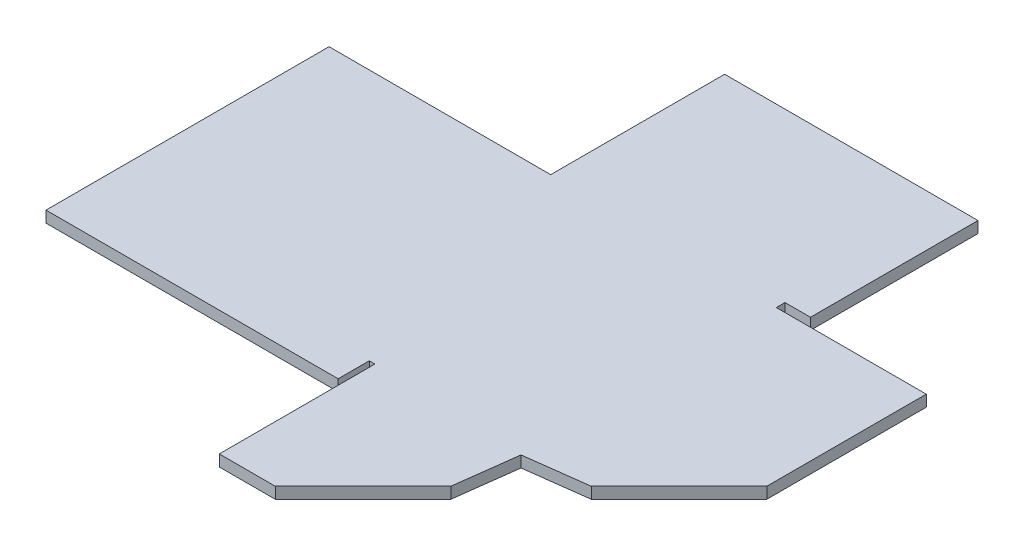
ISO-10303-21;
HEADER;
FILE_DESCRIPTION(('STEP AP214'),'2;1');
FILE_NAME('part.step','',(''),(''),'','','');
FILE_SCHEMA(('AUTOMOTIVE_DESIGN { 1 0 10303 214 1 1 1 1 }'));
ENDSEC;
DATA;
#1=APPLICATION_CONTEXT('core data for automotive mechanical design processes');
#2=APPLICATION_PROTOCOL_DEFINITION('international standard','automotive_design',2000,#1);
#3=PRODUCT_CONTEXT('',#1,'mechanical');
#4=PRODUCT('Part','Part','',(#3));
#5=PRODUCT_RELATED_PRODUCT_CATEGORY('part','',(#4));
#6=PRODUCT_DEFINITION_FORMATION('','',#4);
#7=PRODUCT_DEFINITION_CONTEXT('part definition',#1,'design');
#8=PRODUCT_DEFINITION('design','',#6,#7);
#9=PRODUCT_DEFINITION_SHAPE('','',#8);
#10=(LENGTH_UNIT() NAMED_UNIT(*) SI_UNIT(.MILLI.,.METRE.));
#11=(NAMED_UNIT(*) PLANE_ANGLE_UNIT() SI_UNIT($,.RADIAN.));
#12=(NAMED_UNIT(*) SI_UNIT($,.STERADIAN.) SOLID_ANGLE_UNIT());
#13=UNCERTAINTY_MEASURE_WITH_UNIT(LENGTH_MEASURE(1.E-05),#10,'distance_accuracy_value','');
#14=(GEOMETRIC_REPRESENTATION_CONTEXT(3) GLOBAL_UNCERTAINTY_ASSIGNED_CONTEXT((#13)) GLOBAL_UNIT_ASSIGNED_CONTEXT((#10,
#11,#12)) REPRESENTATION_CONTEXT('',''));
#15=CARTESIAN_POINT('',(0.,0.,0.));
#16=DIRECTION('',(0.,0.,1.));
#17=DIRECTION('',(1.,0.,0.));
#18=AXIS2_PLACEMENT_3D('',#15,#16,#17);
#19=CARTESIAN_POINT('',(-74.445939247954,-1.99999999999994,0.));
#20=DIRECTION('',(0.,0.,1.));
#21=DIRECTION('',(1.,0.,0.));
#22=AXIS2_PLACEMENT_3D('',#19,#20,#21);
#23=PLANE('',#22);
#24=DIRECTION('',(1.,0.,0.));
#25=VECTOR('',#24,1.);
#26=CARTESIAN_POINT('',(-74.445939247954,-1.99999999999994,0.));
#27=LINE('',#26,#25);
#28=CARTESIAN_POINT('',(-83.9155039215777,-2.00000000000312,0.));
#29=VERTEX_POINT('',#28);
#30=CARTESIAN_POINT('',(-32.3072256105192,-2.,0.));
#31=VERTEX_POINT('',#30);
#32=EDGE_CURVE('E100',#29,#31,#27,.T.);
#33=ORIENTED_EDGE('',*,*,#32,.T.);
#34=DIRECTION('',(0.,-1.,0.));
#35=VECTOR('',#34,1.);
#36=CARTESIAN_POINT('',(-32.3072256105192,0.,0.));
#37=LINE('',#36,#35);
#38=CARTESIAN_POINT('',(-32.3072256105192,0.,0.));
#39=VERTEX_POINT('',#38);
#40=EDGE_CURVE('E213',#39,#31,#37,.T.);
#41=ORIENTED_EDGE('',*,*,#40,.F.);
#42=DIRECTION('',(-1.,0.,0.));
#43=VECTOR('',#42,1.);
#44=CARTESIAN_POINT('',(-74.445939247954,0.,0.));
#45=LINE('',#44,#43);
#46=CARTESIAN_POINT('',(-83.9155039215786,-3.12250225675825E-12,0.));
#47=VERTEX_POINT('',#46);
#48=EDGE_CURVE('E83',#47,#39,#45,.F.);
#49=ORIENTED_EDGE('',*,*,#48,.F.);
#50=DIRECTION('',(4.48530101948563E-13,-1.,0.));
#51=VECTOR('',#50,1.);
#52=CARTESIAN_POINT('',(-83.9155039215782,-1.00000000000312,0.));
#53=LINE('',#52,#51);
#54=EDGE_CURVE('E210',#47,#29,#53,.T.);
#55=ORIENTED_EDGE('',*,*,#54,.T.);
#56=EDGE_LOOP('',(#33,#41,#49,#55));
#57=FACE_BOUND('',#56,.T.);
#58=ADVANCED_FACE('F74',(#57),#23,.T.);
#59=CARTESIAN_POINT('',(-74.445939247954,-1.99999999999994,-50.));
#60=DIRECTION('',(0.,0.,-1.));
#61=DIRECTION('',(-1.,0.,0.));
#62=AXIS2_PLACEMENT_3D('',#59,#60,#61);
#63=PLANE('',#62);
#64=DIRECTION('',(-1.,0.,0.));
#65=VECTOR('',#64,1.);
#66=CARTESIAN_POINT('',(-74.445939247954,-1.99999999999994,-50.));
#67=LINE('',#66,#65);
#68=CARTESIAN_POINT('',(-44.7573593128969,-2.,-50.));
#69=VERTEX_POINT('',#68);
#70=CARTESIAN_POINT('',(-83.9155039215777,-2.00000000000312,-50.));
#71=VERTEX_POINT('',#70);
#72=EDGE_CURVE('E206',#69,#71,#67,.T.);
#73=ORIENTED_EDGE('',*,*,#72,.T.);
#74=DIRECTION('',(4.48530101948563E-13,-1.,0.));
#75=VECTOR('',#74,1.);
#76=CARTESIAN_POINT('',(-83.9155039215782,-1.00000000000312,-50.));
#77=LINE('',#76,#75);
#78=CARTESIAN_POINT('',(-83.9155039215786,-3.12250225675825E-12,-50.));
#79=VERTEX_POINT('',#78);
#80=EDGE_CURVE('E224',#79,#71,#77,.T.);
#81=ORIENTED_EDGE('',*,*,#80,.F.);
#82=DIRECTION('',(-1.,0.,0.));
#83=VECTOR('',#82,1.);
#84=CARTESIAN_POINT('',(-74.445939247954,0.,-50.));
#85=LINE('',#84,#83);
#86=CARTESIAN_POINT('',(-44.7573593128969,0.,-50.));
#87=VERTEX_POINT('',#86);
#88=EDGE_CURVE('E13',#87,#79,#85,.T.);
#89=ORIENTED_EDGE('',*,*,#88,.F.);
#90=DIRECTION('',(0.,1.,0.));
#91=VECTOR('',#90,1.);
#92=CARTESIAN_POINT('',(-44.7573593128969,-2.,-49.9999999999953));
#93=LINE('',#92,#91);
#94=EDGE_CURVE('E229',#69,#87,#93,.T.);
#95=ORIENTED_EDGE('',*,*,#94,.F.);
#96=EDGE_LOOP('',(#73,#81,#89,#95));
#97=FACE_BOUND('',#96,.T.);
#98=ADVANCED_FACE('F362',(#97),#63,.T.);
#99=CARTESIAN_POINT('',(0.,0.,0.));
#100=DIRECTION('',(0.,1.,0.));
#101=DIRECTION('',(0.,0.,1.));
#102=AXIS2_PLACEMENT_3D('',#99,#100,#101);
#103=PLANE('',#102);
#104=ORIENTED_EDGE('',*,*,#88,.T.);
#105=DIRECTION('',(0.,0.,1.));
#106=VECTOR('',#105,1.);
#107=CARTESIAN_POINT('',(-83.9155039215786,-3.12250225675825E-12,-25.));
#108=LINE('',#107,#106);
#109=EDGE_CURVE('E219',#47,#79,#108,.F.);
#110=ORIENTED_EDGE('',*,*,#109,.F.);
#111=ORIENTED_EDGE('',*,*,#48,.T.);
#112=DIRECTION('',(0.,0.,1.));
#113=VECTOR('',#112,1.);
#114=CARTESIAN_POINT('',(-32.3072256105192,0.,-5.5));
#115=LINE('',#114,#113);
#116=CARTESIAN_POINT('',(-32.3072256105192,0.,-5.5));
#117=VERTEX_POINT('',#116);
#118=EDGE_CURVE('E248',#117,#39,#115,.T.);
#119=ORIENTED_EDGE('',*,*,#118,.F.);
#120=DIRECTION('',(-1.,0.,0.));
#121=VECTOR('',#120,1.);
#122=CARTESIAN_POINT('',(-31.3072256105192,0.,-5.5));
#123=LINE('',#122,#121);
#124=CARTESIAN_POINT('',(-31.3072256105192,0.,-5.5));
#125=VERTEX_POINT('',#124);
#126=EDGE_CURVE('E254',#125,#117,#123,.T.);
#127=ORIENTED_EDGE('',*,*,#126,.F.);
#128=DIRECTION('',(0.,0.,-1.));
#129=VECTOR('',#128,1.);
#130=CARTESIAN_POINT('',(-31.3072256105192,0.,14.2455742875643));
#131=LINE('',#130,#129);
#132=CARTESIAN_POINT('',(-31.3072256105192,-1.09287578986539E-13,21.9955742875643));
#133=VERTEX_POINT('',#132);
#134=EDGE_CURVE('E306',#125,#133,#131,.F.);
#135=ORIENTED_EDGE('',*,*,#134,.T.);
#136=DIRECTION('',(1.,0.,0.));
#137=VECTOR('',#136,1.);
#138=CARTESIAN_POINT('',(-17.9036128052596,-1.09287578986539E-13,21.9955742875643));
#139=LINE('',#138,#137);
#140=CARTESIAN_POINT('',(-21.4142135623731,-1.09287578986539E-13,21.9955742875643));
#141=VERTEX_POINT('',#140);
#142=EDGE_CURVE('E303',#133,#141,#139,.T.);
#143=ORIENTED_EDGE('',*,*,#142,.T.);
#144=DIRECTION('',(-0.707106781186548,0.,0.707106781186547));
#145=VECTOR('',#144,1.);
#146=CARTESIAN_POINT('',(-15.7839131838163,0.,16.3652739090075));
#147=LINE('',#146,#145);
#148=CARTESIAN_POINT('',(-5.9142135623731,0.,6.49557428756431));
#149=VERTEX_POINT('',#148);
#150=EDGE_CURVE('E222',#149,#141,#147,.T.);
#151=ORIENTED_EDGE('',*,*,#150,.F.);
#152=DIRECTION('',(-0.127565832419806,0.,0.991830105612369));
#153=VECTOR('',#152,1.);
#154=CARTESIAN_POINT('',(-4.5,0.,-4.5));
#155=LINE('',#154,#153);
#156=CARTESIAN_POINT('',(-4.5,0.,-4.5));
#157=VERTEX_POINT('',#156);
#158=EDGE_CURVE('E312',#157,#149,#155,.T.);
#159=ORIENTED_EDGE('',*,*,#158,.F.);
#160=DIRECTION('',(-0.991830105612369,0.,0.127565832419805));
#161=VECTOR('',#160,1.);
#162=CARTESIAN_POINT('',(6.4955742875643,0.,-5.91421356237309));
#163=LINE('',#162,#161);
#164=CARTESIAN_POINT('',(6.49557428756432,0.,-5.9142135623731));
#165=VERTEX_POINT('',#164);
#166=EDGE_CURVE('E299',#165,#157,#163,.T.);
#167=ORIENTED_EDGE('',*,*,#166,.F.);
#168=DIRECTION('',(-0.707106781186548,0.,0.707106781186547));
#169=VECTOR('',#168,1.);
#170=CARTESIAN_POINT('',(20.937460949919,-1.01481323344643E-13,-20.3561002247278));
#171=LINE('',#170,#169);
#172=CARTESIAN_POINT('',(21.9955742875643,-1.09287578986539E-13,-21.4142135623731));
#173=VERTEX_POINT('',#172);
#174=EDGE_CURVE('E332',#173,#165,#171,.T.);
#175=ORIENTED_EDGE('',*,*,#174,.F.);
#176=DIRECTION('',(0.,0.,1.));
#177=VECTOR('',#176,1.);
#178=CARTESIAN_POINT('',(21.9955742875643,-1.09287578986539E-13,-27.0479868870824));
#179=LINE('',#178,#177);
#180=CARTESIAN_POINT('',(21.9955742875643,-1.09287578986539E-13,-49.5959737741648));
#181=VERTEX_POINT('',#180);
#182=EDGE_CURVE('E293',#173,#181,#179,.F.);
#183=ORIENTED_EDGE('',*,*,#182,.T.);
#184=DIRECTION('',(-1.,0.,0.));
#185=VECTOR('',#184,1.);
#186=CARTESIAN_POINT('',(14.2455742875643,0.,-49.5959737741648));
#187=LINE('',#186,#185);
#188=CARTESIAN_POINT('',(-4.5,0.,-49.5959737741648));
#189=VERTEX_POINT('',#188);
#190=EDGE_CURVE('E291',#181,#189,#187,.T.);
#191=ORIENTED_EDGE('',*,*,#190,.T.);
#192=DIRECTION('',(0.,0.,-1.));
#193=VECTOR('',#192,1.);
#194=CARTESIAN_POINT('',(-4.5,0.,-50.3639186450424));
#195=LINE('',#194,#193);
#196=CARTESIAN_POINT('',(-4.5,0.,-51.1318635159199));
#197=VERTEX_POINT('',#196);
#198=EDGE_CURVE('E245',#197,#189,#195,.F.);
#199=ORIENTED_EDGE('',*,*,#198,.F.);
#200=DIRECTION('',(-1.,0.,0.));
#201=VECTOR('',#200,1.);
#202=CARTESIAN_POINT('',(0.,0.,-51.1318635159199));
#203=LINE('',#202,#201);
#204=CARTESIAN_POINT('',(0.,0.,-51.1318635159199));
#205=VERTEX_POINT('',#204);
#206=EDGE_CURVE('E287',#205,#197,#203,.T.);
#207=ORIENTED_EDGE('',*,*,#206,.F.);
#208=DIRECTION('',(0.,0.,1.));
#209=VECTOR('',#208,1.);
#210=CARTESIAN_POINT('',(0.,0.,-50.7278372900848));
#211=LINE('',#210,#209);
#212=CARTESIAN_POINT('',(0.,-2.08166817117217E-13,-80.7278372900848));
#213=VERTEX_POINT('',#212);
#214=EDGE_CURVE('E278',#213,#205,#211,.T.);
#215=ORIENTED_EDGE('',*,*,#214,.F.);
#216=DIRECTION('',(1.,0.,0.));
#217=VECTOR('',#216,1.);
#218=CARTESIAN_POINT('',(0.,-2.08166817117217E-13,-80.7278372900848));
#219=LINE('',#218,#217);
#220=CARTESIAN_POINT('',(-44.757359312897,-2.08166817117217E-13,-80.7278372900847));
#221=VERTEX_POINT('',#220);
#222=EDGE_CURVE('E276',#221,#213,#219,.T.);
#223=ORIENTED_EDGE('',*,*,#222,.F.);
#224=DIRECTION('',(0.,0.,-1.));
#225=VECTOR('',#224,1.);
#226=CARTESIAN_POINT('',(-44.757359312897,-2.08166817117217E-13,-80.7278372900847));
#227=LINE('',#226,#225);
#228=EDGE_CURVE('E195',#87,#221,#227,.T.);
#229=ORIENTED_EDGE('',*,*,#228,.F.);
#230=EDGE_LOOP('',(#104,#110,#111,#119,#127,#135,#143,#151,#159,#167,#175,#183,#191,#199,#207,
#215,#223,#229));
#231=FACE_BOUND('',#230,.T.);
#232=ADVANCED_FACE('F76',(#231),#103,.T.);
#233=CARTESIAN_POINT('',(-74.445939247954,-1.99999999999994,0.));
#234=DIRECTION('',(0.,1.,0.));
#235=DIRECTION('',(-1.,0.,0.));
#236=AXIS2_PLACEMENT_3D('',#233,#234,#235);
#237=PLANE('',#236);
#238=ORIENTED_EDGE('',*,*,#72,.F.);
#239=DIRECTION('',(0.,0.,-1.));
#240=VECTOR('',#239,1.);
#241=CARTESIAN_POINT('',(-44.757359312897,-2.0000000000002,-80.7278372900847));
#242=LINE('',#241,#240);
#243=CARTESIAN_POINT('',(-44.757359312897,-2.0000000000002,-80.7278372900847));
#244=VERTEX_POINT('',#243);
#245=EDGE_CURVE('E91',#69,#244,#242,.T.);
#246=ORIENTED_EDGE('',*,*,#245,.T.);
#247=DIRECTION('',(1.,0.,0.));
#248=VECTOR('',#247,1.);
#249=CARTESIAN_POINT('',(0.,-2.00000000000021,-80.7278372900847));
#250=LINE('',#249,#248);
#251=CARTESIAN_POINT('',(0.,-2.00000000000021,-80.7278372900847));
#252=VERTEX_POINT('',#251);
#253=EDGE_CURVE('E237',#244,#252,#250,.T.);
#254=ORIENTED_EDGE('',*,*,#253,.T.);
#255=DIRECTION('',(0.,0.,1.));
#256=VECTOR('',#255,1.);
#257=CARTESIAN_POINT('',(0.,-2.,-50.7278372900847));
#258=LINE('',#257,#256);
#259=CARTESIAN_POINT('',(0.,-2.00000000000001,-51.1318635159199));
#260=VERTEX_POINT('',#259);
#261=EDGE_CURVE('E234',#252,#260,#258,.T.);
#262=ORIENTED_EDGE('',*,*,#261,.T.);
#263=DIRECTION('',(1.,0.,0.));
#264=VECTOR('',#263,1.);
#265=CARTESIAN_POINT('',(0.,-2.00000000000002,-51.1318635159199));
#266=LINE('',#265,#264);
#267=CARTESIAN_POINT('',(-4.5,-2.00000000000001,-51.1318635159199));
#268=VERTEX_POINT('',#267);
#269=EDGE_CURVE('E289',#268,#260,#266,.T.);
#270=ORIENTED_EDGE('',*,*,#269,.F.);
#271=DIRECTION('',(0.,0.,-1.));
#272=VECTOR('',#271,1.);
#273=CARTESIAN_POINT('',(-4.5,-2.,-50.3639186450424));
#274=LINE('',#273,#272);
#275=CARTESIAN_POINT('',(-4.5,-2.00000000000001,-49.5959737741648));
#276=VERTEX_POINT('',#275);
#277=EDGE_CURVE('E231',#268,#276,#274,.F.);
#278=ORIENTED_EDGE('',*,*,#277,.T.);
#279=DIRECTION('',(-1.,0.,0.));
#280=VECTOR('',#279,1.);
#281=CARTESIAN_POINT('',(14.2455742875643,-2.00000000000006,-49.5959737741648));
#282=LINE('',#281,#280);
#283=CARTESIAN_POINT('',(21.9955742875643,-2.00000000000011,-49.5959737741648));
#284=VERTEX_POINT('',#283);
#285=EDGE_CURVE('E320',#284,#276,#282,.T.);
#286=ORIENTED_EDGE('',*,*,#285,.F.);
#287=DIRECTION('',(0.,0.,-1.));
#288=VECTOR('',#287,1.);
#289=CARTESIAN_POINT('',(21.9955742875643,-2.00000000000011,-27.0479868870824));
#290=LINE('',#289,#288);
#291=CARTESIAN_POINT('',(21.9955742875643,-2.00000000000011,-21.4142135623731));
#292=VERTEX_POINT('',#291);
#293=EDGE_CURVE('E324',#292,#284,#290,.T.);
#294=ORIENTED_EDGE('',*,*,#293,.F.);
#295=DIRECTION('',(-0.707106781186548,0.,0.707106781186547));
#296=VECTOR('',#295,1.);
#297=CARTESIAN_POINT('',(20.937460949919,-2.0000000000001,-20.3561002247278));
#298=LINE('',#297,#296);
#299=CARTESIAN_POINT('',(6.4955742875643,-2.,-5.91421356237309));
#300=VERTEX_POINT('',#299);
#301=EDGE_CURVE('E315',#292,#300,#298,.T.);
#302=ORIENTED_EDGE('',*,*,#301,.T.);
#303=DIRECTION('',(-0.991830105612369,0.,0.127565832419805));
#304=VECTOR('',#303,1.);
#305=CARTESIAN_POINT('',(6.4955742875643,-2.,-5.91421356237309));
#306=LINE('',#305,#304);
#307=CARTESIAN_POINT('',(-4.5,-2.,-4.5));
#308=VERTEX_POINT('',#307);
#309=EDGE_CURVE('E266',#300,#308,#306,.T.);
#310=ORIENTED_EDGE('',*,*,#309,.T.);
#311=DIRECTION('',(-0.127565832419806,0.,0.991830105612369));
#312=VECTOR('',#311,1.);
#313=CARTESIAN_POINT('',(-4.5,-2.,-4.5));
#314=LINE('',#313,#312);
#315=CARTESIAN_POINT('',(-5.9142135623731,-2.,6.4955742875643));
#316=VERTEX_POINT('',#315);
#317=EDGE_CURVE('E268',#308,#316,#314,.T.);
#318=ORIENTED_EDGE('',*,*,#317,.T.);
#319=DIRECTION('',(-0.707106781186548,0.,0.707106781186547));
#320=VECTOR('',#319,1.);
#321=CARTESIAN_POINT('',(-15.7839131838163,-2.00000000000007,16.3652739090075));
#322=LINE('',#321,#320);
#323=CARTESIAN_POINT('',(-21.4142135623731,-2.00000000000011,21.9955742875643));
#324=VERTEX_POINT('',#323);
#325=EDGE_CURVE('E317',#316,#324,#322,.T.);
#326=ORIENTED_EDGE('',*,*,#325,.T.);
#327=DIRECTION('',(1.,0.,0.));
#328=VECTOR('',#327,1.);
#329=CARTESIAN_POINT('',(-17.9036128052596,-2.00000000000011,21.9955742875643));
#330=LINE('',#329,#328);
#331=CARTESIAN_POINT('',(-31.3072256105192,-2.00000000000011,21.9955742875643));
#332=VERTEX_POINT('',#331);
#333=EDGE_CURVE('E337',#332,#324,#330,.T.);
#334=ORIENTED_EDGE('',*,*,#333,.F.);
#335=DIRECTION('',(0.,0.,1.));
#336=VECTOR('',#335,1.);
#337=CARTESIAN_POINT('',(-31.3072256105192,-2.00000000000006,14.2455742875643));
#338=LINE('',#337,#336);
#339=CARTESIAN_POINT('',(-31.3072256105192,-2.,-5.5));
#340=VERTEX_POINT('',#339);
#341=EDGE_CURVE('E334',#340,#332,#338,.T.);
#342=ORIENTED_EDGE('',*,*,#341,.F.);
#343=DIRECTION('',(1.,0.,0.));
#344=VECTOR('',#343,1.);
#345=CARTESIAN_POINT('',(0.,-2.,-5.5));
#346=LINE('',#345,#344);
#347=CARTESIAN_POINT('',(-32.3072256105192,-2.,-5.5));
#348=VERTEX_POINT('',#347);
#349=EDGE_CURVE('E257',#348,#340,#346,.T.);
#350=ORIENTED_EDGE('',*,*,#349,.F.);
#351=DIRECTION('',(0.,0.,-1.));
#352=VECTOR('',#351,1.);
#353=CARTESIAN_POINT('',(-32.3072256105192,-2.,0.));
#354=LINE('',#353,#352);
#355=EDGE_CURVE('E250',#31,#348,#354,.T.);
#356=ORIENTED_EDGE('',*,*,#355,.F.);
#357=ORIENTED_EDGE('',*,*,#32,.F.);
#358=DIRECTION('',(0.,0.,1.));
#359=VECTOR('',#358,1.);
#360=CARTESIAN_POINT('',(-83.9155039215777,-2.00000000000312,-25.));
#361=LINE('',#360,#359);
#362=EDGE_CURVE('E221',#29,#71,#361,.F.);
#363=ORIENTED_EDGE('',*,*,#362,.T.);
#364=EDGE_LOOP('',(#238,#246,#254,#262,#270,#278,#286,#294,#302,#310,#318,#326,#334,#342,#350,
#356,#357,#363));
#365=FACE_BOUND('',#364,.T.);
#366=ADVANCED_FACE('F360',(#365),#237,.F.);
#367=CARTESIAN_POINT('',(-15.7839131838163,-2.00000000000007,16.3652739090075));
#368=DIRECTION('',(0.707106781186547,0.,0.707106781186548));
#369=DIRECTION('',(-0.707106781186548,0.,0.707106781186547));
#370=AXIS2_PLACEMENT_3D('',#367,#368,#369);
#371=PLANE('',#370);
#372=ORIENTED_EDGE('',*,*,#150,.T.);
#373=DIRECTION('',(0.,-1.,0.));
#374=VECTOR('',#373,1.);
#375=CARTESIAN_POINT('',(-21.4142135623731,-2.00000000000011,21.9955742875643));
#376=LINE('',#375,#374);
#377=EDGE_CURVE('E342',#141,#324,#376,.T.);
#378=ORIENTED_EDGE('',*,*,#377,.T.);
#379=ORIENTED_EDGE('',*,*,#325,.F.);
#380=DIRECTION('',(0.,-1.,0.));
#381=VECTOR('',#380,1.);
#382=CARTESIAN_POINT('',(-5.9142135623731,-2.,6.4955742875643));
#383=LINE('',#382,#381);
#384=EDGE_CURVE('E309',#149,#316,#383,.T.);
#385=ORIENTED_EDGE('',*,*,#384,.F.);
#386=EDGE_LOOP('',(#372,#378,#379,#385));
#387=FACE_BOUND('',#386,.T.);
#388=ADVANCED_FACE('F372',(#387),#371,.T.);
#389=CARTESIAN_POINT('',(-17.9036128052596,-2.00000000000011,21.9955742875643));
#390=DIRECTION('',(0.,0.,-1.));
#391=DIRECTION('',(1.,0.,0.));
#392=AXIS2_PLACEMENT_3D('',#389,#390,#391);
#393=PLANE('',#392);
#394=ORIENTED_EDGE('',*,*,#377,.F.);
#395=ORIENTED_EDGE('',*,*,#142,.F.);
#396=DIRECTION('',(0.,-1.,0.));
#397=VECTOR('',#396,1.);
#398=CARTESIAN_POINT('',(-31.3072256105192,-2.00000000000011,21.9955742875643));
#399=LINE('',#398,#397);
#400=EDGE_CURVE('E340',#133,#332,#399,.T.);
#401=ORIENTED_EDGE('',*,*,#400,.T.);
#402=ORIENTED_EDGE('',*,*,#333,.T.);
#403=EDGE_LOOP('',(#394,#395,#401,#402));
#404=FACE_BOUND('',#403,.T.);
#405=ADVANCED_FACE('F418',(#404),#393,.F.);
#406=CARTESIAN_POINT('',(-31.3072256105192,-2.00000000000006,14.2455742875643));
#407=DIRECTION('',(1.,0.,0.));
#408=DIRECTION('',(0.,0.,1.));
#409=AXIS2_PLACEMENT_3D('',#406,#407,#408);
#410=PLANE('',#409);
#411=ORIENTED_EDGE('',*,*,#400,.F.);
#412=ORIENTED_EDGE('',*,*,#134,.F.);
#413=DIRECTION('',(0.,-1.,0.));
#414=VECTOR('',#413,1.);
#415=CARTESIAN_POINT('',(-31.3072256105192,0.,-5.5));
#416=LINE('',#415,#414);
#417=EDGE_CURVE('E263',#125,#340,#416,.T.);
#418=ORIENTED_EDGE('',*,*,#417,.T.);
#419=ORIENTED_EDGE('',*,*,#341,.T.);
#420=EDGE_LOOP('',(#411,#412,#418,#419));
#421=FACE_BOUND('',#420,.T.);
#422=ADVANCED_FACE('F414',(#421),#410,.F.);
#423=CARTESIAN_POINT('',(20.937460949919,-2.0000000000001,-20.3561002247278));
#424=DIRECTION('',(0.707106781186547,0.,0.707106781186548));
#425=DIRECTION('',(-0.707106781186548,0.,0.707106781186547));
#426=AXIS2_PLACEMENT_3D('',#423,#424,#425);
#427=PLANE('',#426);
#428=ORIENTED_EDGE('',*,*,#174,.T.);
#429=DIRECTION('',(0.,-1.,0.));
#430=VECTOR('',#429,1.);
#431=CARTESIAN_POINT('',(6.4955742875643,-2.,-5.9142135623731));
#432=LINE('',#431,#430);
#433=EDGE_CURVE('E329',#165,#300,#432,.T.);
#434=ORIENTED_EDGE('',*,*,#433,.T.);
#435=ORIENTED_EDGE('',*,*,#301,.F.);
#436=DIRECTION('',(0.,-1.,0.));
#437=VECTOR('',#436,1.);
#438=CARTESIAN_POINT('',(21.9955742875643,-2.00000000000011,-21.4142135623731));
#439=LINE('',#438,#437);
#440=EDGE_CURVE('E327',#173,#292,#439,.T.);
#441=ORIENTED_EDGE('',*,*,#440,.F.);
#442=EDGE_LOOP('',(#428,#434,#435,#441));
#443=FACE_BOUND('',#442,.T.);
#444=ADVANCED_FACE('F410',(#443),#427,.T.);
#445=CARTESIAN_POINT('',(21.9955742875643,-2.00000000000011,-27.0479868870824));
#446=DIRECTION('',(-1.,0.,0.));
#447=DIRECTION('',(0.,0.,-1.));
#448=AXIS2_PLACEMENT_3D('',#445,#446,#447);
#449=PLANE('',#448);
#450=DIRECTION('',(0.,-1.,0.));
#451=VECTOR('',#450,1.);
#452=CARTESIAN_POINT('',(21.9955742875643,-2.00000000000011,-49.5959737741648));
#453=LINE('',#452,#451);
#454=EDGE_CURVE('E322',#181,#284,#453,.T.);
#455=ORIENTED_EDGE('',*,*,#454,.F.);
#456=ORIENTED_EDGE('',*,*,#182,.F.);
#457=ORIENTED_EDGE('',*,*,#440,.T.);
#458=ORIENTED_EDGE('',*,*,#293,.T.);
#459=EDGE_LOOP('',(#455,#456,#457,#458));
#460=FACE_BOUND('',#459,.T.);
#461=ADVANCED_FACE('F406',(#460),#449,.F.);
#462=CARTESIAN_POINT('',(14.2455742875643,-2.00000000000006,-49.5959737741648));
#463=DIRECTION('',(0.,0.,1.));
#464=DIRECTION('',(-1.,0.,0.));
#465=AXIS2_PLACEMENT_3D('',#462,#463,#464);
#466=PLANE('',#465);
#467=ORIENTED_EDGE('',*,*,#285,.T.);
#468=DIRECTION('',(0.,-1.,0.));
#469=VECTOR('',#468,1.);
#470=CARTESIAN_POINT('',(-4.5,0.,-49.5959737741648));
#471=LINE('',#470,#469);
#472=EDGE_CURVE('E242',#189,#276,#471,.T.);
#473=ORIENTED_EDGE('',*,*,#472,.F.);
#474=ORIENTED_EDGE('',*,*,#190,.F.);
#475=ORIENTED_EDGE('',*,*,#454,.T.);
#476=EDGE_LOOP('',(#467,#473,#474,#475));
#477=FACE_BOUND('',#476,.T.);
#478=ADVANCED_FACE('F402',(#477),#466,.F.);
#479=CARTESIAN_POINT('',(-4.5,-1.,-4.5));
#480=DIRECTION('',(0.991830105612369,0.,0.127565832419806));
#481=DIRECTION('',(-0.127565832419806,0.,0.991830105612369));
#482=AXIS2_PLACEMENT_3D('',#479,#480,#481);
#483=PLANE('',#482);
#484=DIRECTION('',(0.,-1.,0.));
#485=VECTOR('',#484,1.);
#486=CARTESIAN_POINT('',(-4.5,0.,-4.5));
#487=LINE('',#486,#485);
#488=EDGE_CURVE('E296',#157,#308,#487,.T.);
#489=ORIENTED_EDGE('',*,*,#488,.F.);
#490=ORIENTED_EDGE('',*,*,#158,.T.);
#491=ORIENTED_EDGE('',*,*,#384,.T.);
#492=ORIENTED_EDGE('',*,*,#317,.F.);
#493=EDGE_LOOP('',(#489,#490,#491,#492));
#494=FACE_BOUND('',#493,.T.);
#495=ADVANCED_FACE('F398',(#494),#483,.T.);
#496=CARTESIAN_POINT('',(6.4955742875643,-1.,-5.91421356237309));
#497=DIRECTION('',(0.127565832419805,0.,0.991830105612369));
#498=DIRECTION('',(-0.991830105612369,0.,0.127565832419805));
#499=AXIS2_PLACEMENT_3D('',#496,#497,#498);
#500=PLANE('',#499);
#501=ORIENTED_EDGE('',*,*,#166,.T.);
#502=ORIENTED_EDGE('',*,*,#488,.T.);
#503=ORIENTED_EDGE('',*,*,#309,.F.);
#504=ORIENTED_EDGE('',*,*,#433,.F.);
#505=EDGE_LOOP('',(#501,#502,#503,#504));
#506=FACE_BOUND('',#505,.T.);
#507=ADVANCED_FACE('F394',(#506),#500,.T.);
#508=CARTESIAN_POINT('',(0.,34.7329185229497,-51.1318635159202));
#509=DIRECTION('',(0.,0.,-1.));
#510=DIRECTION('',(0.,1.,0.));
#511=AXIS2_PLACEMENT_3D('',#508,#509,#510);
#512=PLANE('',#511);
#513=DIRECTION('',(0.,1.,0.));
#514=VECTOR('',#513,1.);
#515=CARTESIAN_POINT('',(-4.5,-2.00000000000001,-51.1318635159199));
#516=LINE('',#515,#514);
#517=EDGE_CURVE('E239',#268,#197,#516,.T.);
#518=ORIENTED_EDGE('',*,*,#517,.F.);
#519=ORIENTED_EDGE('',*,*,#269,.T.);
#520=DIRECTION('',(0.,-1.,0.));
#521=VECTOR('',#520,1.);
#522=CARTESIAN_POINT('',(0.,0.,-51.1318635159199));
#523=LINE('',#522,#521);
#524=EDGE_CURVE('E284',#205,#260,#523,.T.);
#525=ORIENTED_EDGE('',*,*,#524,.F.);
#526=ORIENTED_EDGE('',*,*,#206,.T.);
#527=EDGE_LOOP('',(#518,#519,#525,#526));
#528=FACE_BOUND('',#527,.T.);
#529=ADVANCED_FACE('F391',(#528),#512,.F.);
#530=CARTESIAN_POINT('',(0.,-2.,-50.7278372900847));
#531=DIRECTION('',(-1.,0.,0.));
#532=DIRECTION('',(0.,0.694658370458999,0.71933980033865));
#533=AXIS2_PLACEMENT_3D('',#530,#531,#532);
#534=PLANE('',#533);
#535=ORIENTED_EDGE('',*,*,#524,.T.);
#536=ORIENTED_EDGE('',*,*,#261,.F.);
#537=DIRECTION('',(0.,1.,0.));
#538=VECTOR('',#537,1.);
#539=CARTESIAN_POINT('',(0.,-2.00000000000021,-80.7278372900847));
#540=LINE('',#539,#538);
#541=EDGE_CURVE('E281',#252,#213,#540,.T.);
#542=ORIENTED_EDGE('',*,*,#541,.T.);
#543=ORIENTED_EDGE('',*,*,#214,.T.);
#544=EDGE_LOOP('',(#535,#536,#542,#543));
#545=FACE_BOUND('',#544,.T.);
#546=ADVANCED_FACE('F357',(#545),#534,.F.);
#547=CARTESIAN_POINT('',(0.,-2.00000000000021,-80.7278372900847));
#548=DIRECTION('',(0.,0.,1.));
#549=DIRECTION('',(0.,-1.,0.));
#550=AXIS2_PLACEMENT_3D('',#547,#548,#549);
#551=PLANE('',#550);
#552=ORIENTED_EDGE('',*,*,#222,.T.);
#553=ORIENTED_EDGE('',*,*,#541,.F.);
#554=ORIENTED_EDGE('',*,*,#253,.F.);
#555=DIRECTION('',(0.,1.,0.));
#556=VECTOR('',#555,1.);
#557=CARTESIAN_POINT('',(-44.757359312897,-2.0000000000002,-80.7278372900847));
#558=LINE('',#557,#556);
#559=EDGE_CURVE('E273',#244,#221,#558,.T.);
#560=ORIENTED_EDGE('',*,*,#559,.T.);
#561=EDGE_LOOP('',(#552,#553,#554,#560));
#562=FACE_BOUND('',#561,.T.);
#563=ADVANCED_FACE('F351',(#562),#551,.F.);
#564=CARTESIAN_POINT('',(-31.3072256105192,0.,-5.5));
#565=DIRECTION('',(0.,0.,1.));
#566=DIRECTION('',(0.,-1.,0.));
#567=AXIS2_PLACEMENT_3D('',#564,#565,#566);
#568=PLANE('',#567);
#569=DIRECTION('',(0.,-1.,0.));
#570=VECTOR('',#569,1.);
#571=CARTESIAN_POINT('',(-32.3072256105192,0.,-5.5));
#572=LINE('',#571,#570);
#573=EDGE_CURVE('E260',#117,#348,#572,.T.);
#574=ORIENTED_EDGE('',*,*,#573,.T.);
#575=ORIENTED_EDGE('',*,*,#349,.T.);
#576=ORIENTED_EDGE('',*,*,#417,.F.);
#577=ORIENTED_EDGE('',*,*,#126,.T.);
#578=EDGE_LOOP('',(#574,#575,#576,#577));
#579=FACE_BOUND('',#578,.T.);
#580=ADVANCED_FACE('F382',(#579),#568,.T.);
#581=CARTESIAN_POINT('',(-32.3072256105192,0.,-5.5));
#582=DIRECTION('',(1.,0.,0.));
#583=DIRECTION('',(0.,0.,-1.));
#584=AXIS2_PLACEMENT_3D('',#581,#582,#583);
#585=PLANE('',#584);
#586=ORIENTED_EDGE('',*,*,#40,.T.);
#587=ORIENTED_EDGE('',*,*,#355,.T.);
#588=ORIENTED_EDGE('',*,*,#573,.F.);
#589=ORIENTED_EDGE('',*,*,#118,.T.);
#590=EDGE_LOOP('',(#586,#587,#588,#589));
#591=FACE_BOUND('',#590,.T.);
#592=ADVANCED_FACE('F379',(#591),#585,.T.);
#593=CARTESIAN_POINT('',(-44.757359312897,-2.0000000000002,-80.7278372900847));
#594=DIRECTION('',(1.,0.,0.));
#595=DIRECTION('',(0.,0.71933980033865,-0.694658370458999));
#596=AXIS2_PLACEMENT_3D('',#593,#594,#595);
#597=PLANE('',#596);
#598=ORIENTED_EDGE('',*,*,#245,.F.);
#599=ORIENTED_EDGE('',*,*,#94,.T.);
#600=ORIENTED_EDGE('',*,*,#228,.T.);
#601=ORIENTED_EDGE('',*,*,#559,.F.);
#602=EDGE_LOOP('',(#598,#599,#600,#601));
#603=FACE_BOUND('',#602,.T.);
#604=ADVANCED_FACE('F348',(#603),#597,.F.);
#605=CARTESIAN_POINT('',(-4.5,-0.999999999999997,-50.3639186450424));
#606=DIRECTION('',(-1.,0.,0.));
#607=DIRECTION('',(0.,0.,-1.));
#608=AXIS2_PLACEMENT_3D('',#605,#606,#607);
#609=PLANE('',#608);
#610=ORIENTED_EDGE('',*,*,#198,.T.);
#611=ORIENTED_EDGE('',*,*,#472,.T.);
#612=ORIENTED_EDGE('',*,*,#277,.F.);
#613=ORIENTED_EDGE('',*,*,#517,.T.);
#614=EDGE_LOOP('',(#610,#611,#612,#613));
#615=FACE_BOUND('',#614,.T.);
#616=ADVANCED_FACE('F373',(#615),#609,.F.);
#617=CARTESIAN_POINT('',(-83.9155039215782,-1.00000000000312,-25.));
#618=DIRECTION('',(1.,4.48530101948563E-13,0.));
#619=DIRECTION('',(0.,0.,1.));
#620=AXIS2_PLACEMENT_3D('',#617,#618,#619);
#621=PLANE('',#620);
#622=ORIENTED_EDGE('',*,*,#54,.F.);
#623=ORIENTED_EDGE('',*,*,#109,.T.);
#624=ORIENTED_EDGE('',*,*,#80,.T.);
#625=ORIENTED_EDGE('',*,*,#362,.F.);
#626=EDGE_LOOP('',(#622,#623,#624,#625));
#627=FACE_BOUND('',#626,.T.);
#628=ADVANCED_FACE('F218',(#627),#621,.F.);
#629=CLOSED_SHELL('',(#58,#98,#232,#366,#388,#405,#422,#444,#461,#478,#495,#507,#529,#546,#563,
#580,#592,#604,#616,#628));
#630=MANIFOLD_SOLID_BREP('B2',#629);
#631=ADVANCED_BREP_SHAPE_REPRESENTATION('',(#18,#630),#14);
#632=SHAPE_DEFINITION_REPRESENTATION(#9,#631);
ENDSEC;
END-ISO-10303-21;
